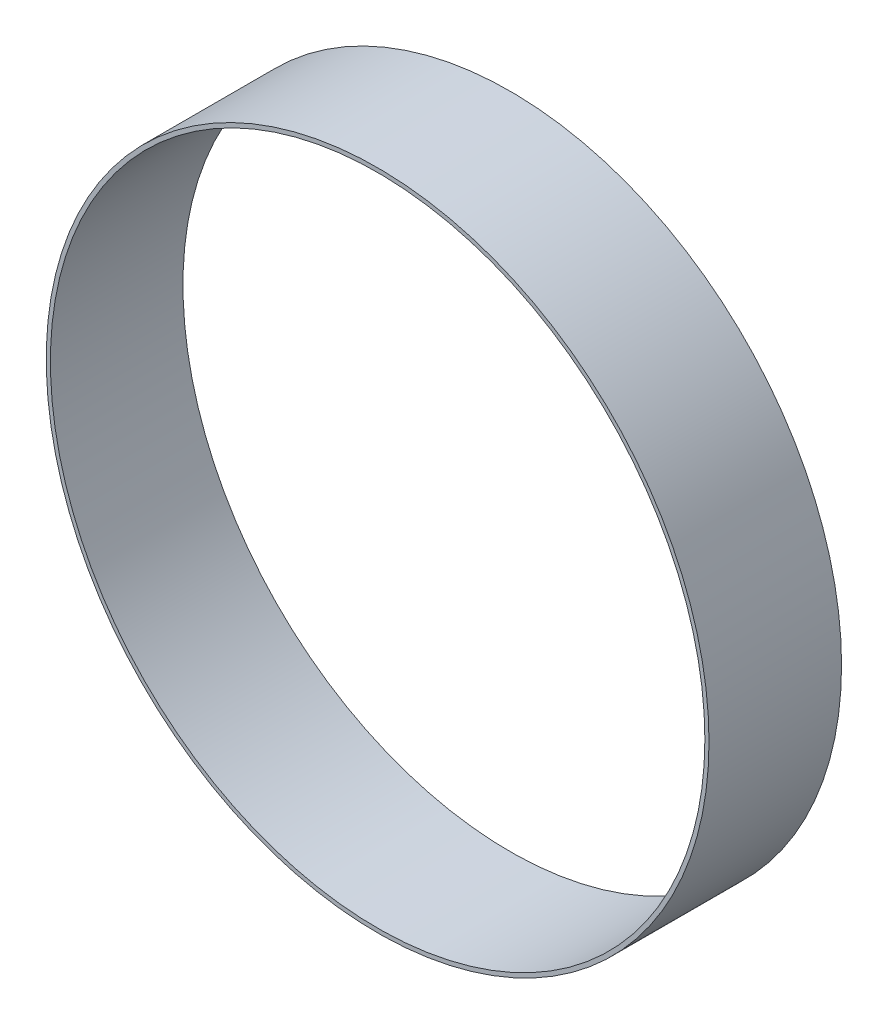
ISO-10303-21;
HEADER;
FILE_DESCRIPTION(('STEP AP214'),'2;1');
FILE_NAME('part.step','',(''),(''),'','','');
FILE_SCHEMA(('AUTOMOTIVE_DESIGN { 1 0 10303 214 1 1 1 1 }'));
ENDSEC;
DATA;
#1=APPLICATION_CONTEXT('core data for automotive mechanical design processes');
#2=APPLICATION_PROTOCOL_DEFINITION('international standard','automotive_design',2000,#1);
#3=PRODUCT_CONTEXT('',#1,'mechanical');
#4=PRODUCT('Part','Part','',(#3));
#5=PRODUCT_RELATED_PRODUCT_CATEGORY('part','',(#4));
#6=PRODUCT_DEFINITION_FORMATION('','',#4);
#7=PRODUCT_DEFINITION_CONTEXT('part definition',#1,'design');
#8=PRODUCT_DEFINITION('design','',#6,#7);
#9=PRODUCT_DEFINITION_SHAPE('','',#8);
#10=(LENGTH_UNIT() NAMED_UNIT(*) SI_UNIT(.MILLI.,.METRE.));
#11=(NAMED_UNIT(*) PLANE_ANGLE_UNIT() SI_UNIT($,.RADIAN.));
#12=(NAMED_UNIT(*) SI_UNIT($,.STERADIAN.) SOLID_ANGLE_UNIT());
#13=UNCERTAINTY_MEASURE_WITH_UNIT(LENGTH_MEASURE(1.E-05),#10,'distance_accuracy_value','');
#14=(GEOMETRIC_REPRESENTATION_CONTEXT(3) GLOBAL_UNCERTAINTY_ASSIGNED_CONTEXT((#13)) GLOBAL_UNIT_ASSIGNED_CONTEXT((#10,
#11,#12)) REPRESENTATION_CONTEXT('',''));
#15=CARTESIAN_POINT('',(0.,0.,0.));
#16=DIRECTION('',(0.,0.,1.));
#17=DIRECTION('',(1.,0.,0.));
#18=AXIS2_PLACEMENT_3D('',#15,#16,#17);
#19=CARTESIAN_POINT('',(0.,0.,50.8));
#20=DIRECTION('',(0.,0.,-1.));
#21=DIRECTION('',(-1.,0.,0.));
#22=AXIS2_PLACEMENT_3D('',#19,#20,#21);
#23=CYLINDRICAL_SURFACE('',#22,127.);
#24=CARTESIAN_POINT('',(0.,0.,50.8));
#25=DIRECTION('',(0.,0.,1.));
#26=DIRECTION('',(1.,0.,0.));
#27=AXIS2_PLACEMENT_3D('',#24,#25,#26);
#28=CIRCLE('',#27,127.);
#29=CARTESIAN_POINT('',(127.,0.,50.8));
#30=VERTEX_POINT('',#29);
#31=EDGE_CURVE('E10',#30,#30,#28,.T.);
#32=ORIENTED_EDGE('',*,*,#31,.F.);
#33=EDGE_LOOP('',(#32));
#34=FACE_BOUND('',#33,.T.);
#35=CARTESIAN_POINT('',(0.,0.,0.));
#36=DIRECTION('',(0.,0.,1.));
#37=DIRECTION('',(1.,0.,0.));
#38=AXIS2_PLACEMENT_3D('',#35,#36,#37);
#39=CIRCLE('',#38,127.);
#40=CARTESIAN_POINT('',(127.,0.,0.));
#41=VERTEX_POINT('',#40);
#42=EDGE_CURVE('E42',#41,#41,#39,.T.);
#43=ORIENTED_EDGE('',*,*,#42,.T.);
#44=EDGE_LOOP('',(#43));
#45=FACE_BOUND('',#44,.T.);
#46=ADVANCED_FACE('F39',(#34,#45),#23,.T.);
#47=CARTESIAN_POINT('',(0.,0.,50.8));
#48=DIRECTION('',(0.,0.,1.));
#49=DIRECTION('',(1.,0.,0.));
#50=AXIS2_PLACEMENT_3D('',#47,#48,#49);
#51=PLANE('',#50);
#52=CARTESIAN_POINT('',(0.,0.,50.8));
#53=DIRECTION('',(0.,0.,1.));
#54=DIRECTION('',(1.,0.,0.));
#55=AXIS2_PLACEMENT_3D('',#52,#53,#54);
#56=CIRCLE('',#55,125.4125);
#57=CARTESIAN_POINT('',(125.4125,0.,50.8));
#58=VERTEX_POINT('',#57);
#59=EDGE_CURVE('E51',#58,#58,#56,.T.);
#60=ORIENTED_EDGE('',*,*,#59,.F.);
#61=EDGE_LOOP('',(#60));
#62=FACE_BOUND('',#61,.T.);
#63=ORIENTED_EDGE('',*,*,#31,.T.);
#64=EDGE_LOOP('',(#63));
#65=FACE_BOUND('',#64,.T.);
#66=ADVANCED_FACE('F66',(#62,#65),#51,.T.);
#67=CARTESIAN_POINT('',(0.,0.,0.));
#68=DIRECTION('',(0.,0.,1.));
#69=DIRECTION('',(1.,0.,0.));
#70=AXIS2_PLACEMENT_3D('',#67,#68,#69);
#71=PLANE('',#70);
#72=CARTESIAN_POINT('',(0.,0.,0.));
#73=DIRECTION('',(0.,0.,1.));
#74=DIRECTION('',(1.,0.,0.));
#75=AXIS2_PLACEMENT_3D('',#72,#73,#74);
#76=CIRCLE('',#75,125.4125);
#77=CARTESIAN_POINT('',(125.4125,0.,0.));
#78=VERTEX_POINT('',#77);
#79=EDGE_CURVE('E49',#78,#78,#76,.T.);
#80=ORIENTED_EDGE('',*,*,#79,.T.);
#81=EDGE_LOOP('',(#80));
#82=FACE_BOUND('',#81,.T.);
#83=ORIENTED_EDGE('',*,*,#42,.F.);
#84=EDGE_LOOP('',(#83));
#85=FACE_BOUND('',#84,.T.);
#86=ADVANCED_FACE('F57',(#82,#85),#71,.F.);
#87=CARTESIAN_POINT('',(0.,0.,0.));
#88=DIRECTION('',(0.,0.,1.));
#89=DIRECTION('',(1.,0.,0.));
#90=AXIS2_PLACEMENT_3D('',#87,#88,#89);
#91=CYLINDRICAL_SURFACE('',#90,125.4125);
#92=ORIENTED_EDGE('',*,*,#79,.F.);
#93=EDGE_LOOP('',(#92));
#94=FACE_BOUND('',#93,.T.);
#95=ORIENTED_EDGE('',*,*,#59,.T.);
#96=EDGE_LOOP('',(#95));
#97=FACE_BOUND('',#96,.T.);
#98=ADVANCED_FACE('F60',(#94,#97),#91,.F.);
#99=CLOSED_SHELL('',(#46,#66,#86,#98));
#100=MANIFOLD_SOLID_BREP('B2',#99);
#101=ADVANCED_BREP_SHAPE_REPRESENTATION('',(#18,#100),#14);
#102=SHAPE_DEFINITION_REPRESENTATION(#9,#101);
ENDSEC;
END-ISO-10303-21;
